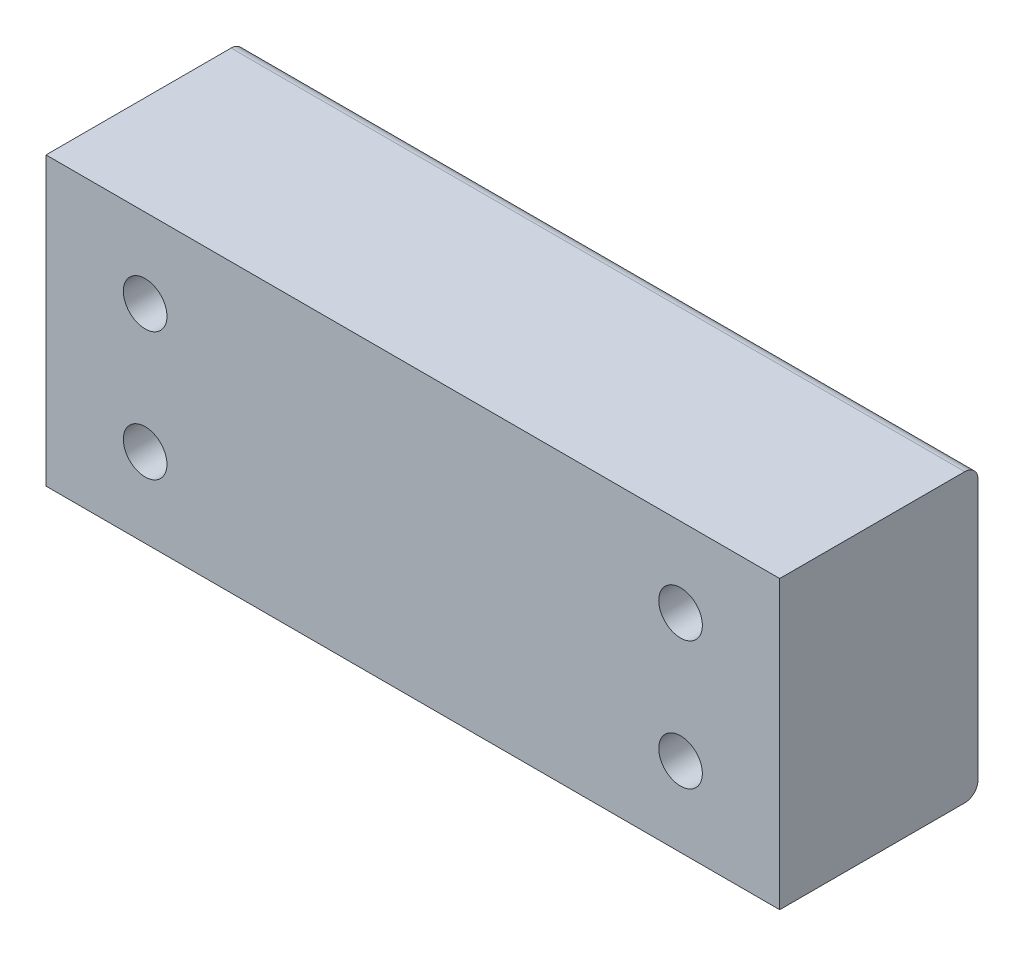
ISO-10303-21;
HEADER;
FILE_DESCRIPTION(('STEP AP214'),'2;1');
FILE_NAME('part.step','',(''),(''),'','','');
FILE_SCHEMA(('AUTOMOTIVE_DESIGN { 1 0 10303 214 1 1 1 1 }'));
ENDSEC;
DATA;
#1=APPLICATION_CONTEXT('core data for automotive mechanical design processes');
#2=APPLICATION_PROTOCOL_DEFINITION('international standard','automotive_design',2000,#1);
#3=PRODUCT_CONTEXT('',#1,'mechanical');
#4=PRODUCT('Part','Part','',(#3));
#5=PRODUCT_RELATED_PRODUCT_CATEGORY('part','',(#4));
#6=PRODUCT_DEFINITION_FORMATION('','',#4);
#7=PRODUCT_DEFINITION_CONTEXT('part definition',#1,'design');
#8=PRODUCT_DEFINITION('design','',#6,#7);
#9=PRODUCT_DEFINITION_SHAPE('','',#8);
#10=(LENGTH_UNIT() NAMED_UNIT(*) SI_UNIT(.MILLI.,.METRE.));
#11=(NAMED_UNIT(*) PLANE_ANGLE_UNIT() SI_UNIT($,.RADIAN.));
#12=(NAMED_UNIT(*) SI_UNIT($,.STERADIAN.) SOLID_ANGLE_UNIT());
#13=UNCERTAINTY_MEASURE_WITH_UNIT(LENGTH_MEASURE(1.E-05),#10,'distance_accuracy_value','');
#14=(GEOMETRIC_REPRESENTATION_CONTEXT(3) GLOBAL_UNCERTAINTY_ASSIGNED_CONTEXT((#13)) GLOBAL_UNIT_ASSIGNED_CONTEXT((#10,
#11,#12)) REPRESENTATION_CONTEXT('',''));
#15=CARTESIAN_POINT('',(0.,0.,0.));
#16=DIRECTION('',(0.,0.,1.));
#17=DIRECTION('',(1.,0.,0.));
#18=AXIS2_PLACEMENT_3D('',#15,#16,#17);
#19=CARTESIAN_POINT('',(27.75,-10.85,15.));
#20=DIRECTION('',(-1.,0.,0.));
#21=DIRECTION('',(0.,0.,1.));
#22=AXIS2_PLACEMENT_3D('',#19,#20,#21);
#23=PLANE('',#22);
#24=DIRECTION('',(0.,0.,-1.));
#25=VECTOR('',#24,1.);
#26=CARTESIAN_POINT('',(27.75,-10.85,15.));
#27=LINE('',#26,#25);
#28=CARTESIAN_POINT('',(27.75,-10.85,15.));
#29=VERTEX_POINT('',#28);
#30=CARTESIAN_POINT('',(27.75,-10.85,1.));
#31=VERTEX_POINT('',#30);
#32=EDGE_CURVE('E142',#29,#31,#27,.T.);
#33=ORIENTED_EDGE('',*,*,#32,.T.);
#34=CARTESIAN_POINT('',(27.75,-9.85,1.));
#35=DIRECTION('',(-1.,0.,0.));
#36=DIRECTION('',(0.,0.,1.));
#37=AXIS2_PLACEMENT_3D('',#34,#35,#36);
#38=CIRCLE('',#37,1.);
#39=CARTESIAN_POINT('',(27.75,-9.85,0.));
#40=VERTEX_POINT('',#39);
#41=EDGE_CURVE('E128',#31,#40,#38,.F.);
#42=ORIENTED_EDGE('',*,*,#41,.T.);
#43=DIRECTION('',(0.,1.,0.));
#44=VECTOR('',#43,1.);
#45=CARTESIAN_POINT('',(27.75,-10.85,0.));
#46=LINE('',#45,#44);
#47=CARTESIAN_POINT('',(27.75,9.85,0.));
#48=VERTEX_POINT('',#47);
#49=EDGE_CURVE('E144',#40,#48,#46,.T.);
#50=ORIENTED_EDGE('',*,*,#49,.T.);
#51=CARTESIAN_POINT('',(27.75,9.85,1.));
#52=DIRECTION('',(-1.,0.,0.));
#53=DIRECTION('',(0.,0.,1.));
#54=AXIS2_PLACEMENT_3D('',#51,#52,#53);
#55=CIRCLE('',#54,1.);
#56=CARTESIAN_POINT('',(27.75,10.85,1.));
#57=VERTEX_POINT('',#56);
#58=EDGE_CURVE('E118',#48,#57,#55,.F.);
#59=ORIENTED_EDGE('',*,*,#58,.T.);
#60=DIRECTION('',(0.,0.,-1.));
#61=VECTOR('',#60,1.);
#62=CARTESIAN_POINT('',(27.75,10.85,15.));
#63=LINE('',#62,#61);
#64=CARTESIAN_POINT('',(27.75,10.85,15.));
#65=VERTEX_POINT('',#64);
#66=EDGE_CURVE('E99',#65,#57,#63,.T.);
#67=ORIENTED_EDGE('',*,*,#66,.F.);
#68=DIRECTION('',(0.,1.,0.));
#69=VECTOR('',#68,1.);
#70=CARTESIAN_POINT('',(27.75,-10.85,15.));
#71=LINE('',#70,#69);
#72=EDGE_CURVE('E105',#29,#65,#71,.T.);
#73=ORIENTED_EDGE('',*,*,#72,.F.);
#74=EDGE_LOOP('',(#33,#42,#50,#59,#67,#73));
#75=FACE_BOUND('',#74,.T.);
#76=ADVANCED_FACE('F40',(#75),#23,.F.);
#77=CARTESIAN_POINT('',(-27.75,10.85,15.));
#78=DIRECTION('',(0.,-1.,0.));
#79=DIRECTION('',(0.,0.,-1.));
#80=AXIS2_PLACEMENT_3D('',#77,#78,#79);
#81=PLANE('',#80);
#82=ORIENTED_EDGE('',*,*,#66,.T.);
#83=DIRECTION('',(-1.,0.,0.));
#84=VECTOR('',#83,1.);
#85=CARTESIAN_POINT('',(-27.75,10.85,1.));
#86=LINE('',#85,#84);
#87=CARTESIAN_POINT('',(-27.75,10.85,1.));
#88=VERTEX_POINT('',#87);
#89=EDGE_CURVE('E11',#57,#88,#86,.T.);
#90=ORIENTED_EDGE('',*,*,#89,.T.);
#91=DIRECTION('',(0.,0.,-1.));
#92=VECTOR('',#91,1.);
#93=CARTESIAN_POINT('',(-27.75,10.85,15.));
#94=LINE('',#93,#92);
#95=CARTESIAN_POINT('',(-27.75,10.85,15.));
#96=VERTEX_POINT('',#95);
#97=EDGE_CURVE('E101',#96,#88,#94,.T.);
#98=ORIENTED_EDGE('',*,*,#97,.F.);
#99=DIRECTION('',(-1.,0.,0.));
#100=VECTOR('',#99,1.);
#101=CARTESIAN_POINT('',(-27.75,10.85,15.));
#102=LINE('',#101,#100);
#103=EDGE_CURVE('E95',#65,#96,#102,.T.);
#104=ORIENTED_EDGE('',*,*,#103,.F.);
#105=EDGE_LOOP('',(#82,#90,#98,#104));
#106=FACE_BOUND('',#105,.T.);
#107=ADVANCED_FACE('F97',(#106),#81,.F.);
#108=CARTESIAN_POINT('',(-27.75,-10.85,15.));
#109=DIRECTION('',(1.,0.,0.));
#110=DIRECTION('',(0.,0.,-1.));
#111=AXIS2_PLACEMENT_3D('',#108,#109,#110);
#112=PLANE('',#111);
#113=DIRECTION('',(0.,-1.,0.));
#114=VECTOR('',#113,1.);
#115=CARTESIAN_POINT('',(-27.75,-10.85,0.));
#116=LINE('',#115,#114);
#117=CARTESIAN_POINT('',(-27.75,9.85,0.));
#118=VERTEX_POINT('',#117);
#119=CARTESIAN_POINT('',(-27.75,-9.85,0.));
#120=VERTEX_POINT('',#119);
#121=EDGE_CURVE('E114',#118,#120,#116,.T.);
#122=ORIENTED_EDGE('',*,*,#121,.T.);
#123=CARTESIAN_POINT('',(-27.75,-9.85,1.));
#124=DIRECTION('',(1.,0.,0.));
#125=DIRECTION('',(0.,0.,-1.));
#126=AXIS2_PLACEMENT_3D('',#123,#124,#125);
#127=CIRCLE('',#126,1.);
#128=CARTESIAN_POINT('',(-27.75,-10.85,1.));
#129=VERTEX_POINT('',#128);
#130=EDGE_CURVE('E48',#120,#129,#127,.F.);
#131=ORIENTED_EDGE('',*,*,#130,.T.);
#132=DIRECTION('',(0.,0.,-1.));
#133=VECTOR('',#132,1.);
#134=CARTESIAN_POINT('',(-27.75,-10.85,15.));
#135=LINE('',#134,#133);
#136=CARTESIAN_POINT('',(-27.75,-10.85,15.));
#137=VERTEX_POINT('',#136);
#138=EDGE_CURVE('E123',#137,#129,#135,.T.);
#139=ORIENTED_EDGE('',*,*,#138,.F.);
#140=DIRECTION('',(0.,-1.,0.));
#141=VECTOR('',#140,1.);
#142=CARTESIAN_POINT('',(-27.75,-10.85,15.));
#143=LINE('',#142,#141);
#144=EDGE_CURVE('E104',#96,#137,#143,.T.);
#145=ORIENTED_EDGE('',*,*,#144,.F.);
#146=ORIENTED_EDGE('',*,*,#97,.T.);
#147=CARTESIAN_POINT('',(-27.75,9.85,1.));
#148=DIRECTION('',(1.,0.,0.));
#149=DIRECTION('',(0.,0.,-1.));
#150=AXIS2_PLACEMENT_3D('',#147,#148,#149);
#151=CIRCLE('',#150,1.);
#152=EDGE_CURVE('E55',#88,#118,#151,.F.);
#153=ORIENTED_EDGE('',*,*,#152,.T.);
#154=EDGE_LOOP('',(#122,#131,#139,#145,#146,#153));
#155=FACE_BOUND('',#154,.T.);
#156=ADVANCED_FACE('F137',(#155),#112,.F.);
#157=CARTESIAN_POINT('',(-27.75,-10.85,15.));
#158=DIRECTION('',(0.,1.,0.));
#159=DIRECTION('',(0.,0.,1.));
#160=AXIS2_PLACEMENT_3D('',#157,#158,#159);
#161=PLANE('',#160);
#162=ORIENTED_EDGE('',*,*,#138,.T.);
#163=DIRECTION('',(1.,0.,0.));
#164=VECTOR('',#163,1.);
#165=CARTESIAN_POINT('',(27.75,-10.85,1.));
#166=LINE('',#165,#164);
#167=EDGE_CURVE('E119',#129,#31,#166,.T.);
#168=ORIENTED_EDGE('',*,*,#167,.T.);
#169=ORIENTED_EDGE('',*,*,#32,.F.);
#170=DIRECTION('',(1.,0.,0.));
#171=VECTOR('',#170,1.);
#172=CARTESIAN_POINT('',(-27.75,-10.85,15.));
#173=LINE('',#172,#171);
#174=EDGE_CURVE('E110',#137,#29,#173,.T.);
#175=ORIENTED_EDGE('',*,*,#174,.F.);
#176=EDGE_LOOP('',(#162,#168,#169,#175));
#177=FACE_BOUND('',#176,.T.);
#178=ADVANCED_FACE('F141',(#177),#161,.F.);
#179=CARTESIAN_POINT('',(0.,0.,15.));
#180=DIRECTION('',(0.,0.,-1.));
#181=DIRECTION('',(-1.,0.,0.));
#182=AXIS2_PLACEMENT_3D('',#179,#180,#181);
#183=PLANE('',#182);
#184=CARTESIAN_POINT('',(20.25,4.85,15.));
#185=DIRECTION('',(0.,0.,1.));
#186=DIRECTION('',(-1.,0.,0.));
#187=AXIS2_PLACEMENT_3D('',#184,#185,#186);
#188=CIRCLE('',#187,1.65);
#189=CARTESIAN_POINT('',(18.6,4.85,15.));
#190=VERTEX_POINT('',#189);
#191=EDGE_CURVE('E162',#190,#190,#188,.T.);
#192=ORIENTED_EDGE('',*,*,#191,.F.);
#193=EDGE_LOOP('',(#192));
#194=FACE_BOUND('',#193,.T.);
#195=CARTESIAN_POINT('',(20.25,-4.85,15.));
#196=DIRECTION('',(0.,0.,1.));
#197=DIRECTION('',(1.,0.,0.));
#198=AXIS2_PLACEMENT_3D('',#195,#196,#197);
#199=CIRCLE('',#198,1.64999999999999);
#200=CARTESIAN_POINT('',(21.9,-4.85,15.));
#201=VERTEX_POINT('',#200);
#202=EDGE_CURVE('E168',#201,#201,#199,.T.);
#203=ORIENTED_EDGE('',*,*,#202,.F.);
#204=EDGE_LOOP('',(#203));
#205=FACE_BOUND('',#204,.T.);
#206=CARTESIAN_POINT('',(-20.25,-4.85,15.));
#207=DIRECTION('',(0.,0.,1.));
#208=DIRECTION('',(-1.,0.,0.));
#209=AXIS2_PLACEMENT_3D('',#206,#207,#208);
#210=CIRCLE('',#209,1.64999999999999);
#211=CARTESIAN_POINT('',(-21.9,-4.85,15.));
#212=VERTEX_POINT('',#211);
#213=EDGE_CURVE('E157',#212,#212,#210,.T.);
#214=ORIENTED_EDGE('',*,*,#213,.F.);
#215=EDGE_LOOP('',(#214));
#216=FACE_BOUND('',#215,.T.);
#217=CARTESIAN_POINT('',(-20.25,4.85,15.));
#218=DIRECTION('',(0.,0.,1.));
#219=DIRECTION('',(1.,0.,0.));
#220=AXIS2_PLACEMENT_3D('',#217,#218,#219);
#221=CIRCLE('',#220,1.65);
#222=CARTESIAN_POINT('',(-18.6,4.85,15.));
#223=VERTEX_POINT('',#222);
#224=EDGE_CURVE('E150',#223,#223,#221,.T.);
#225=ORIENTED_EDGE('',*,*,#224,.F.);
#226=EDGE_LOOP('',(#225));
#227=FACE_BOUND('',#226,.T.);
#228=ORIENTED_EDGE('',*,*,#72,.T.);
#229=ORIENTED_EDGE('',*,*,#103,.T.);
#230=ORIENTED_EDGE('',*,*,#144,.T.);
#231=ORIENTED_EDGE('',*,*,#174,.T.);
#232=EDGE_LOOP('',(#228,#229,#230,#231));
#233=FACE_BOUND('',#232,.T.);
#234=ADVANCED_FACE('F108',(#194,#205,#216,#227,#233),#183,.F.);
#235=CARTESIAN_POINT('',(0.,0.,0.));
#236=DIRECTION('',(0.,0.,-1.));
#237=DIRECTION('',(-1.,0.,0.));
#238=AXIS2_PLACEMENT_3D('',#235,#236,#237);
#239=PLANE('',#238);
#240=CARTESIAN_POINT('',(20.25,4.85,0.));
#241=DIRECTION('',(0.,0.,1.));
#242=DIRECTION('',(-1.,0.,0.));
#243=AXIS2_PLACEMENT_3D('',#240,#241,#242);
#244=CIRCLE('',#243,1.65);
#245=CARTESIAN_POINT('',(18.6,4.85,0.));
#246=VERTEX_POINT('',#245);
#247=EDGE_CURVE('E159',#246,#246,#244,.T.);
#248=ORIENTED_EDGE('',*,*,#247,.T.);
#249=EDGE_LOOP('',(#248));
#250=FACE_BOUND('',#249,.T.);
#251=CARTESIAN_POINT('',(20.25,-4.85,0.));
#252=DIRECTION('',(0.,0.,1.));
#253=DIRECTION('',(1.,0.,0.));
#254=AXIS2_PLACEMENT_3D('',#251,#252,#253);
#255=CIRCLE('',#254,1.64999999999999);
#256=CARTESIAN_POINT('',(21.9,-4.85,0.));
#257=VERTEX_POINT('',#256);
#258=EDGE_CURVE('E165',#257,#257,#255,.T.);
#259=ORIENTED_EDGE('',*,*,#258,.T.);
#260=EDGE_LOOP('',(#259));
#261=FACE_BOUND('',#260,.T.);
#262=CARTESIAN_POINT('',(-20.25,-4.85,0.));
#263=DIRECTION('',(0.,0.,1.));
#264=DIRECTION('',(-1.,0.,0.));
#265=AXIS2_PLACEMENT_3D('',#262,#263,#264);
#266=CIRCLE('',#265,1.64999999999999);
#267=CARTESIAN_POINT('',(-21.9,-4.85,0.));
#268=VERTEX_POINT('',#267);
#269=EDGE_CURVE('E171',#268,#268,#266,.T.);
#270=ORIENTED_EDGE('',*,*,#269,.T.);
#271=EDGE_LOOP('',(#270));
#272=FACE_BOUND('',#271,.T.);
#273=CARTESIAN_POINT('',(-20.25,4.85,0.));
#274=DIRECTION('',(0.,0.,1.));
#275=DIRECTION('',(1.,0.,0.));
#276=AXIS2_PLACEMENT_3D('',#273,#274,#275);
#277=CIRCLE('',#276,1.65);
#278=CARTESIAN_POINT('',(-18.6,4.85,0.));
#279=VERTEX_POINT('',#278);
#280=EDGE_CURVE('E146',#279,#279,#277,.T.);
#281=ORIENTED_EDGE('',*,*,#280,.T.);
#282=EDGE_LOOP('',(#281));
#283=FACE_BOUND('',#282,.T.);
#284=ORIENTED_EDGE('',*,*,#49,.F.);
#285=DIRECTION('',(1.,0.,0.));
#286=VECTOR('',#285,1.);
#287=CARTESIAN_POINT('',(-27.75,-9.85,0.));
#288=LINE('',#287,#286);
#289=EDGE_CURVE('E62',#40,#120,#288,.F.);
#290=ORIENTED_EDGE('',*,*,#289,.T.);
#291=ORIENTED_EDGE('',*,*,#121,.F.);
#292=DIRECTION('',(-1.,0.,0.));
#293=VECTOR('',#292,1.);
#294=CARTESIAN_POINT('',(27.75,9.85,0.));
#295=LINE('',#294,#293);
#296=EDGE_CURVE('E130',#118,#48,#295,.F.);
#297=ORIENTED_EDGE('',*,*,#296,.T.);
#298=EDGE_LOOP('',(#284,#290,#291,#297));
#299=FACE_BOUND('',#298,.T.);
#300=ADVANCED_FACE('F145',(#250,#261,#272,#283,#299),#239,.T.);
#301=CARTESIAN_POINT('',(-20.25,4.85,0.));
#302=DIRECTION('',(0.,0.,1.));
#303=DIRECTION('',(1.,0.,0.));
#304=AXIS2_PLACEMENT_3D('',#301,#302,#303);
#305=CYLINDRICAL_SURFACE('',#304,1.65);
#306=ORIENTED_EDGE('',*,*,#280,.F.);
#307=EDGE_LOOP('',(#306));
#308=FACE_BOUND('',#307,.T.);
#309=ORIENTED_EDGE('',*,*,#224,.T.);
#310=EDGE_LOOP('',(#309));
#311=FACE_BOUND('',#310,.T.);
#312=ADVANCED_FACE('F185',(#308,#311),#305,.F.);
#313=CARTESIAN_POINT('',(-20.25,-4.85,0.));
#314=DIRECTION('',(0.,0.,1.));
#315=DIRECTION('',(1.,0.,0.));
#316=AXIS2_PLACEMENT_3D('',#313,#314,#315);
#317=CYLINDRICAL_SURFACE('',#316,1.64999999999999);
#318=ORIENTED_EDGE('',*,*,#269,.F.);
#319=EDGE_LOOP('',(#318));
#320=FACE_BOUND('',#319,.T.);
#321=ORIENTED_EDGE('',*,*,#213,.T.);
#322=EDGE_LOOP('',(#321));
#323=FACE_BOUND('',#322,.T.);
#324=ADVANCED_FACE('F177',(#320,#323),#317,.F.);
#325=CARTESIAN_POINT('',(20.25,-4.85,0.));
#326=DIRECTION('',(0.,0.,1.));
#327=DIRECTION('',(1.,0.,0.));
#328=AXIS2_PLACEMENT_3D('',#325,#326,#327);
#329=CYLINDRICAL_SURFACE('',#328,1.64999999999999);
#330=ORIENTED_EDGE('',*,*,#258,.F.);
#331=EDGE_LOOP('',(#330));
#332=FACE_BOUND('',#331,.T.);
#333=ORIENTED_EDGE('',*,*,#202,.T.);
#334=EDGE_LOOP('',(#333));
#335=FACE_BOUND('',#334,.T.);
#336=ADVANCED_FACE('F193',(#332,#335),#329,.F.);
#337=CARTESIAN_POINT('',(20.25,4.85,0.));
#338=DIRECTION('',(0.,0.,1.));
#339=DIRECTION('',(1.,0.,0.));
#340=AXIS2_PLACEMENT_3D('',#337,#338,#339);
#341=CYLINDRICAL_SURFACE('',#340,1.65);
#342=ORIENTED_EDGE('',*,*,#247,.F.);
#343=EDGE_LOOP('',(#342));
#344=FACE_BOUND('',#343,.T.);
#345=ORIENTED_EDGE('',*,*,#191,.T.);
#346=EDGE_LOOP('',(#345));
#347=FACE_BOUND('',#346,.T.);
#348=ADVANCED_FACE('F208',(#344,#347),#341,.F.);
#349=CARTESIAN_POINT('',(-27.75,-9.85,1.));
#350=DIRECTION('',(-1.,0.,0.));
#351=DIRECTION('',(0.,0.,1.));
#352=AXIS2_PLACEMENT_3D('',#349,#350,#351);
#353=CYLINDRICAL_SURFACE('',#352,1.);
#354=ORIENTED_EDGE('',*,*,#130,.F.);
#355=ORIENTED_EDGE('',*,*,#289,.F.);
#356=ORIENTED_EDGE('',*,*,#41,.F.);
#357=ORIENTED_EDGE('',*,*,#167,.F.);
#358=EDGE_LOOP('',(#354,#355,#356,#357));
#359=FACE_BOUND('',#358,.T.);
#360=ADVANCED_FACE('F143',(#359),#353,.T.);
#361=CARTESIAN_POINT('',(-27.75,9.85,1.));
#362=DIRECTION('',(1.,0.,0.));
#363=DIRECTION('',(0.,0.,-1.));
#364=AXIS2_PLACEMENT_3D('',#361,#362,#363);
#365=CYLINDRICAL_SURFACE('',#364,1.);
#366=ORIENTED_EDGE('',*,*,#58,.F.);
#367=ORIENTED_EDGE('',*,*,#296,.F.);
#368=ORIENTED_EDGE('',*,*,#152,.F.);
#369=ORIENTED_EDGE('',*,*,#89,.F.);
#370=EDGE_LOOP('',(#366,#367,#368,#369));
#371=FACE_BOUND('',#370,.T.);
#372=ADVANCED_FACE('F42',(#371),#365,.T.);
#373=CLOSED_SHELL('',(#76,#107,#156,#178,#234,#300,#312,#324,#336,#348,#360,#372));
#374=MANIFOLD_SOLID_BREP('B2',#373);
#375=ADVANCED_BREP_SHAPE_REPRESENTATION('',(#18,#374),#14);
#376=SHAPE_DEFINITION_REPRESENTATION(#9,#375);
ENDSEC;
END-ISO-10303-21;
